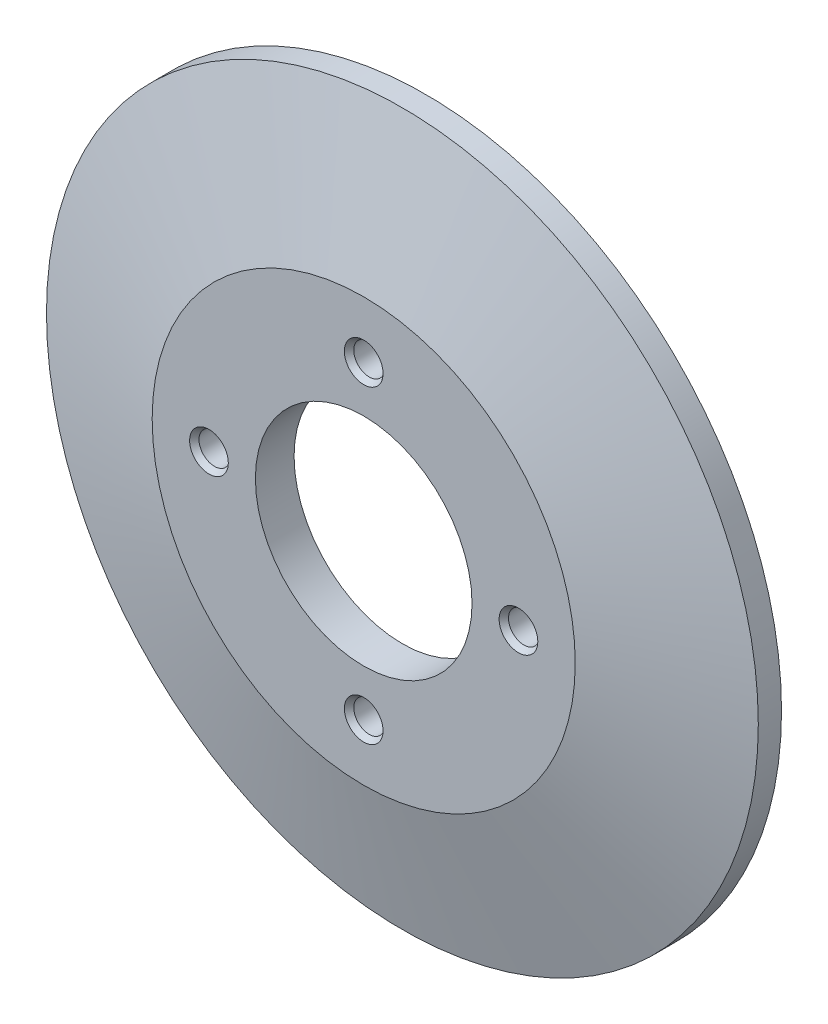
ISO-10303-21;
HEADER;
FILE_DESCRIPTION(('STEP AP214'),'2;1');
FILE_NAME('part.step','',(''),(''),'','','');
FILE_SCHEMA(('AUTOMOTIVE_DESIGN { 1 0 10303 214 1 1 1 1 }'));
ENDSEC;
DATA;
#1=APPLICATION_CONTEXT('core data for automotive mechanical design processes');
#2=APPLICATION_PROTOCOL_DEFINITION('international standard','automotive_design',2000,#1);
#3=PRODUCT_CONTEXT('',#1,'mechanical');
#4=PRODUCT('Part','Part','',(#3));
#5=PRODUCT_RELATED_PRODUCT_CATEGORY('part','',(#4));
#6=PRODUCT_DEFINITION_FORMATION('','',#4);
#7=PRODUCT_DEFINITION_CONTEXT('part definition',#1,'design');
#8=PRODUCT_DEFINITION('design','',#6,#7);
#9=PRODUCT_DEFINITION_SHAPE('','',#8);
#10=(LENGTH_UNIT() NAMED_UNIT(*) SI_UNIT(.MILLI.,.METRE.));
#11=(NAMED_UNIT(*) PLANE_ANGLE_UNIT() SI_UNIT($,.RADIAN.));
#12=(NAMED_UNIT(*) SI_UNIT($,.STERADIAN.) SOLID_ANGLE_UNIT());
#13=UNCERTAINTY_MEASURE_WITH_UNIT(LENGTH_MEASURE(1.E-05),#10,'distance_accuracy_value','');
#14=(GEOMETRIC_REPRESENTATION_CONTEXT(3) GLOBAL_UNCERTAINTY_ASSIGNED_CONTEXT((#13)) GLOBAL_UNIT_ASSIGNED_CONTEXT((#10,
#11,#12)) REPRESENTATION_CONTEXT('',''));
#15=CARTESIAN_POINT('',(0.,0.,0.));
#16=DIRECTION('',(0.,0.,1.));
#17=DIRECTION('',(1.,0.,0.));
#18=AXIS2_PLACEMENT_3D('',#15,#16,#17);
#19=CARTESIAN_POINT('',(0.,0.,3.));
#20=DIRECTION('',(0.,0.,-1.));
#21=DIRECTION('',(-1.,0.,0.));
#22=AXIS2_PLACEMENT_3D('',#19,#20,#21);
#23=CYLINDRICAL_SURFACE('',#22,46.);
#24=CARTESIAN_POINT('',(0.,0.,3.));
#25=DIRECTION('',(0.,0.,1.));
#26=DIRECTION('',(1.,0.,0.));
#27=AXIS2_PLACEMENT_3D('',#24,#25,#26);
#28=CIRCLE('',#27,46.);
#29=CARTESIAN_POINT('',(46.,0.,3.));
#30=VERTEX_POINT('',#29);
#31=EDGE_CURVE('E63',#30,#30,#28,.T.);
#32=ORIENTED_EDGE('',*,*,#31,.F.);
#33=EDGE_LOOP('',(#32));
#34=FACE_BOUND('',#33,.T.);
#35=CARTESIAN_POINT('',(0.,0.,0.));
#36=DIRECTION('',(0.,0.,1.));
#37=DIRECTION('',(1.,0.,0.));
#38=AXIS2_PLACEMENT_3D('',#35,#36,#37);
#39=CIRCLE('',#38,46.);
#40=CARTESIAN_POINT('',(46.,0.,0.));
#41=VERTEX_POINT('',#40);
#42=EDGE_CURVE('E81',#41,#41,#39,.T.);
#43=ORIENTED_EDGE('',*,*,#42,.T.);
#44=EDGE_LOOP('',(#43));
#45=FACE_BOUND('',#44,.T.);
#46=ADVANCED_FACE('F31',(#34,#45),#23,.T.);
#47=CARTESIAN_POINT('',(0.,0.,0.));
#48=DIRECTION('',(0.,0.,1.));
#49=DIRECTION('',(1.,0.,0.));
#50=AXIS2_PLACEMENT_3D('',#47,#48,#49);
#51=PLANE('',#50);
#52=CARTESIAN_POINT('',(0.,0.,0.));
#53=DIRECTION('',(0.,0.,1.));
#54=DIRECTION('',(1.,0.,0.));
#55=AXIS2_PLACEMENT_3D('',#52,#53,#54);
#56=CIRCLE('',#55,37.8776358969252);
#57=CARTESIAN_POINT('',(37.8776358969252,0.,0.));
#58=VERTEX_POINT('',#57);
#59=EDGE_CURVE('E89',#58,#58,#56,.T.);
#60=ORIENTED_EDGE('',*,*,#59,.T.);
#61=EDGE_LOOP('',(#60));
#62=FACE_BOUND('',#61,.T.);
#63=ORIENTED_EDGE('',*,*,#42,.F.);
#64=EDGE_LOOP('',(#63));
#65=FACE_BOUND('',#64,.T.);
#66=ADVANCED_FACE('F111',(#62,#65),#51,.F.);
#67=CARTESIAN_POINT('',(0.,0.,3.));
#68=DIRECTION('',(0.,0.,-1.));
#69=DIRECTION('',(1.,0.,0.));
#70=AXIS2_PLACEMENT_3D('',#67,#68,#69);
#71=CONICAL_SURFACE('',#70,46.,1.30899693899575);
#72=CARTESIAN_POINT('',(0.,0.,8.));
#73=DIRECTION('',(0.,0.,1.));
#74=DIRECTION('',(1.,0.,0.));
#75=AXIS2_PLACEMENT_3D('',#72,#73,#74);
#76=CIRCLE('',#75,27.3397459621555);
#77=CARTESIAN_POINT('',(27.3397459621555,0.,8.));
#78=VERTEX_POINT('',#77);
#79=EDGE_CURVE('E84',#78,#78,#76,.T.);
#80=ORIENTED_EDGE('',*,*,#79,.F.);
#81=EDGE_LOOP('',(#80));
#82=FACE_BOUND('',#81,.T.);
#83=ORIENTED_EDGE('',*,*,#31,.T.);
#84=EDGE_LOOP('',(#83));
#85=FACE_BOUND('',#84,.T.);
#86=ADVANCED_FACE('F104',(#82,#85),#71,.T.);
#87=CARTESIAN_POINT('',(0.,0.,8.));
#88=DIRECTION('',(0.,0.,1.));
#89=DIRECTION('',(1.,0.,0.));
#90=AXIS2_PLACEMENT_3D('',#87,#88,#89);
#91=PLANE('',#90);
#92=CARTESIAN_POINT('',(-19.9999999999994,-5.6843418860808E-13,8.));
#93=DIRECTION('',(0.,0.,1.));
#94=DIRECTION('',(1.,0.,0.));
#95=AXIS2_PLACEMENT_3D('',#92,#93,#94);
#96=CIRCLE('',#95,2.50000000000089);
#97=CARTESIAN_POINT('',(-17.4999999999985,-5.6843418860808E-13,8.));
#98=VERTEX_POINT('',#97);
#99=EDGE_CURVE('E46',#98,#98,#96,.F.);
#100=ORIENTED_EDGE('',*,*,#99,.T.);
#101=EDGE_LOOP('',(#100));
#102=FACE_BOUND('',#101,.T.);
#103=CARTESIAN_POINT('',(1.13196979001957E-12,-20.,8.));
#104=DIRECTION('',(0.,0.,1.));
#105=DIRECTION('',(1.,0.,0.));
#106=AXIS2_PLACEMENT_3D('',#103,#104,#105);
#107=CIRCLE('',#106,2.50000000000124);
#108=CARTESIAN_POINT('',(2.50000000000237,-20.,8.));
#109=VERTEX_POINT('',#108);
#110=EDGE_CURVE('E51',#109,#109,#107,.F.);
#111=ORIENTED_EDGE('',*,*,#110,.T.);
#112=EDGE_LOOP('',(#111));
#113=FACE_BOUND('',#112,.T.);
#114=CARTESIAN_POINT('',(20.0000000000006,5.65984895009786E-13,8.));
#115=DIRECTION('',(0.,0.,1.));
#116=DIRECTION('',(1.,0.,0.));
#117=AXIS2_PLACEMENT_3D('',#114,#115,#116);
#118=CIRCLE('',#117,2.50000000000045);
#119=CARTESIAN_POINT('',(22.500000000001,5.65984895009786E-13,8.));
#120=VERTEX_POINT('',#119);
#121=EDGE_CURVE('E54',#120,#120,#118,.F.);
#122=ORIENTED_EDGE('',*,*,#121,.T.);
#123=EDGE_LOOP('',(#122));
#124=FACE_BOUND('',#123,.T.);
#125=CARTESIAN_POINT('',(0.,20.,8.));
#126=DIRECTION('',(0.,0.,1.));
#127=DIRECTION('',(1.,0.,0.));
#128=AXIS2_PLACEMENT_3D('',#125,#126,#127);
#129=CIRCLE('',#128,2.50000000000002);
#130=CARTESIAN_POINT('',(2.50000000000002,20.,8.));
#131=VERTEX_POINT('',#130);
#132=EDGE_CURVE('E57',#131,#131,#129,.F.);
#133=ORIENTED_EDGE('',*,*,#132,.T.);
#134=EDGE_LOOP('',(#133));
#135=FACE_BOUND('',#134,.T.);
#136=CARTESIAN_POINT('',(0.,0.,8.));
#137=DIRECTION('',(0.,0.,1.));
#138=DIRECTION('',(1.,0.,0.));
#139=AXIS2_PLACEMENT_3D('',#136,#137,#138);
#140=CIRCLE('',#139,14.);
#141=CARTESIAN_POINT('',(14.,0.,8.));
#142=VERTEX_POINT('',#141);
#143=EDGE_CURVE('E68',#142,#142,#140,.T.);
#144=ORIENTED_EDGE('',*,*,#143,.F.);
#145=EDGE_LOOP('',(#144));
#146=FACE_BOUND('',#145,.T.);
#147=ORIENTED_EDGE('',*,*,#79,.T.);
#148=EDGE_LOOP('',(#147));
#149=FACE_BOUND('',#148,.T.);
#150=ADVANCED_FACE('F100',(#102,#113,#124,#135,#146,#149),#91,.T.);
#151=CARTESIAN_POINT('',(0.,0.,-1.82962913144534));
#152=DIRECTION('',(0.,0.,-1.));
#153=DIRECTION('',(1.,0.,0.));
#154=AXIS2_PLACEMENT_3D('',#151,#152,#153);
#155=CONICAL_SURFACE('',#154,44.7059047744874,1.30899693899575);
#156=CARTESIAN_POINT('',(0.,0.,3.));
#157=DIRECTION('',(0.,0.,1.));
#158=DIRECTION('',(1.,0.,0.));
#159=AXIS2_PLACEMENT_3D('',#156,#157,#158);
#160=CIRCLE('',#159,26.6814834742185);
#161=CARTESIAN_POINT('',(26.6814834742185,0.,3.));
#162=VERTEX_POINT('',#161);
#163=EDGE_CURVE('E80',#162,#162,#160,.T.);
#164=ORIENTED_EDGE('',*,*,#163,.T.);
#165=EDGE_LOOP('',(#164));
#166=FACE_BOUND('',#165,.T.);
#167=ORIENTED_EDGE('',*,*,#59,.F.);
#168=EDGE_LOOP('',(#167));
#169=FACE_BOUND('',#168,.T.);
#170=ADVANCED_FACE('F103',(#166,#169),#155,.F.);
#171=CARTESIAN_POINT('',(0.,0.,3.));
#172=DIRECTION('',(0.,0.,1.));
#173=DIRECTION('',(1.,0.,0.));
#174=AXIS2_PLACEMENT_3D('',#171,#172,#173);
#175=PLANE('',#174);
#176=CARTESIAN_POINT('',(0.,0.,3.));
#177=DIRECTION('',(0.,0.,1.));
#178=DIRECTION('',(1.,0.,0.));
#179=AXIS2_PLACEMENT_3D('',#176,#177,#178);
#180=CIRCLE('',#179,14.);
#181=CARTESIAN_POINT('',(14.,0.,3.));
#182=VERTEX_POINT('',#181);
#183=EDGE_CURVE('E64',#182,#182,#180,.T.);
#184=ORIENTED_EDGE('',*,*,#183,.T.);
#185=EDGE_LOOP('',(#184));
#186=FACE_BOUND('',#185,.T.);
#187=CARTESIAN_POINT('',(20.0000000000006,5.65984895009786E-13,3.));
#188=DIRECTION('',(0.,0.,1.));
#189=DIRECTION('',(1.,0.,0.));
#190=AXIS2_PLACEMENT_3D('',#187,#188,#189);
#191=CIRCLE('',#190,2.00000000000044);
#192=CARTESIAN_POINT('',(22.000000000001,5.65984895009786E-13,3.));
#193=VERTEX_POINT('',#192);
#194=EDGE_CURVE('E69',#193,#193,#191,.T.);
#195=ORIENTED_EDGE('',*,*,#194,.T.);
#196=EDGE_LOOP('',(#195));
#197=FACE_BOUND('',#196,.T.);
#198=CARTESIAN_POINT('',(1.13196979001957E-12,-20.,3.));
#199=DIRECTION('',(0.,0.,1.));
#200=DIRECTION('',(1.,0.,0.));
#201=AXIS2_PLACEMENT_3D('',#198,#199,#200);
#202=CIRCLE('',#201,2.00000000000122);
#203=CARTESIAN_POINT('',(2.00000000000235,-20.,3.));
#204=VERTEX_POINT('',#203);
#205=EDGE_CURVE('E73',#204,#204,#202,.T.);
#206=ORIENTED_EDGE('',*,*,#205,.T.);
#207=EDGE_LOOP('',(#206));
#208=FACE_BOUND('',#207,.T.);
#209=CARTESIAN_POINT('',(-19.9999999999994,-5.6843418860808E-13,3.));
#210=DIRECTION('',(0.,0.,1.));
#211=DIRECTION('',(1.,0.,0.));
#212=AXIS2_PLACEMENT_3D('',#209,#210,#211);
#213=CIRCLE('',#212,2.00000000000091);
#214=CARTESIAN_POINT('',(-17.9999999999985,-5.6843418860808E-13,3.));
#215=VERTEX_POINT('',#214);
#216=EDGE_CURVE('E67',#215,#215,#213,.T.);
#217=ORIENTED_EDGE('',*,*,#216,.T.);
#218=EDGE_LOOP('',(#217));
#219=FACE_BOUND('',#218,.T.);
#220=CARTESIAN_POINT('',(0.,20.,3.));
#221=DIRECTION('',(0.,0.,1.));
#222=DIRECTION('',(1.,0.,0.));
#223=AXIS2_PLACEMENT_3D('',#220,#221,#222);
#224=CIRCLE('',#223,2.);
#225=CARTESIAN_POINT('',(2.,20.,3.));
#226=VERTEX_POINT('',#225);
#227=EDGE_CURVE('E72',#226,#226,#224,.T.);
#228=ORIENTED_EDGE('',*,*,#227,.T.);
#229=EDGE_LOOP('',(#228));
#230=FACE_BOUND('',#229,.T.);
#231=ORIENTED_EDGE('',*,*,#163,.F.);
#232=EDGE_LOOP('',(#231));
#233=FACE_BOUND('',#232,.T.);
#234=ADVANCED_FACE('F197',(#186,#197,#208,#219,#230,#233),#175,.F.);
#235=CARTESIAN_POINT('',(0.,20.,0.));
#236=DIRECTION('',(0.,0.,1.));
#237=DIRECTION('',(1.,0.,0.));
#238=AXIS2_PLACEMENT_3D('',#235,#236,#237);
#239=CYLINDRICAL_SURFACE('',#238,2.);
#240=CARTESIAN_POINT('',(0.,20.,7.28592599662892));
#241=DIRECTION('',(0.,0.,1.));
#242=DIRECTION('',(1.,0.,0.));
#243=AXIS2_PLACEMENT_3D('',#240,#241,#242);
#244=CIRCLE('',#243,2.);
#245=CARTESIAN_POINT('',(2.,20.,7.28592599662892));
#246=VERTEX_POINT('',#245);
#247=EDGE_CURVE('E10',#246,#246,#244,.T.);
#248=ORIENTED_EDGE('',*,*,#247,.T.);
#249=EDGE_LOOP('',(#248));
#250=FACE_BOUND('',#249,.T.);
#251=ORIENTED_EDGE('',*,*,#227,.F.);
#252=EDGE_LOOP('',(#251));
#253=FACE_BOUND('',#252,.T.);
#254=ADVANCED_FACE('F190',(#250,#253),#239,.F.);
#255=CARTESIAN_POINT('',(-19.9999999999994,-5.6843418860808E-13,0.));
#256=DIRECTION('',(0.,0.,1.));
#257=DIRECTION('',(1.,0.,0.));
#258=AXIS2_PLACEMENT_3D('',#255,#256,#257);
#259=CYLINDRICAL_SURFACE('',#258,2.00000000000091);
#260=CARTESIAN_POINT('',(-19.9999999999994,-5.6843418860808E-13,7.28592599662897));
#261=DIRECTION('',(0.,0.,1.));
#262=DIRECTION('',(1.,0.,0.));
#263=AXIS2_PLACEMENT_3D('',#260,#261,#262);
#264=CIRCLE('',#263,2.00000000000091);
#265=CARTESIAN_POINT('',(-17.9999999999985,-5.6843418860808E-13,7.28592599662897));
#266=VERTEX_POINT('',#265);
#267=EDGE_CURVE('E60',#266,#266,#264,.T.);
#268=ORIENTED_EDGE('',*,*,#267,.T.);
#269=EDGE_LOOP('',(#268));
#270=FACE_BOUND('',#269,.T.);
#271=ORIENTED_EDGE('',*,*,#216,.F.);
#272=EDGE_LOOP('',(#271));
#273=FACE_BOUND('',#272,.T.);
#274=ADVANCED_FACE('F182',(#270,#273),#259,.F.);
#275=CARTESIAN_POINT('',(1.13196979001957E-12,-20.,0.));
#276=DIRECTION('',(0.,0.,1.));
#277=DIRECTION('',(1.,0.,0.));
#278=AXIS2_PLACEMENT_3D('',#275,#276,#277);
#279=CYLINDRICAL_SURFACE('',#278,2.00000000000122);
#280=CARTESIAN_POINT('',(1.13196979001957E-12,-20.,7.28592599662894));
#281=DIRECTION('',(0.,0.,1.));
#282=DIRECTION('',(1.,0.,0.));
#283=AXIS2_PLACEMENT_3D('',#280,#281,#282);
#284=CIRCLE('',#283,2.00000000000122);
#285=CARTESIAN_POINT('',(2.00000000000235,-20.,7.28592599662894));
#286=VERTEX_POINT('',#285);
#287=EDGE_CURVE('E42',#286,#286,#284,.T.);
#288=ORIENTED_EDGE('',*,*,#287,.T.);
#289=EDGE_LOOP('',(#288));
#290=FACE_BOUND('',#289,.T.);
#291=ORIENTED_EDGE('',*,*,#205,.F.);
#292=EDGE_LOOP('',(#291));
#293=FACE_BOUND('',#292,.T.);
#294=ADVANCED_FACE('F175',(#290,#293),#279,.F.);
#295=CARTESIAN_POINT('',(20.0000000000006,5.65984895009786E-13,0.));
#296=DIRECTION('',(0.,0.,1.));
#297=DIRECTION('',(1.,0.,0.));
#298=AXIS2_PLACEMENT_3D('',#295,#296,#297);
#299=CYLINDRICAL_SURFACE('',#298,2.00000000000044);
#300=CARTESIAN_POINT('',(20.0000000000006,5.65984895009786E-13,7.28592599662894));
#301=DIRECTION('',(0.,0.,1.));
#302=DIRECTION('',(1.,0.,0.));
#303=AXIS2_PLACEMENT_3D('',#300,#301,#302);
#304=CIRCLE('',#303,2.00000000000044);
#305=CARTESIAN_POINT('',(22.000000000001,5.65984895009786E-13,7.28592599662894));
#306=VERTEX_POINT('',#305);
#307=EDGE_CURVE('E38',#306,#306,#304,.T.);
#308=ORIENTED_EDGE('',*,*,#307,.T.);
#309=EDGE_LOOP('',(#308));
#310=FACE_BOUND('',#309,.T.);
#311=ORIENTED_EDGE('',*,*,#194,.F.);
#312=EDGE_LOOP('',(#311));
#313=FACE_BOUND('',#312,.T.);
#314=ADVANCED_FACE('F171',(#310,#313),#299,.F.);
#315=CARTESIAN_POINT('',(0.,0.,0.));
#316=DIRECTION('',(0.,0.,1.));
#317=DIRECTION('',(1.,0.,0.));
#318=AXIS2_PLACEMENT_3D('',#315,#316,#317);
#319=CYLINDRICAL_SURFACE('',#318,14.);
#320=ORIENTED_EDGE('',*,*,#143,.T.);
#321=EDGE_LOOP('',(#320));
#322=FACE_BOUND('',#321,.T.);
#323=ORIENTED_EDGE('',*,*,#183,.F.);
#324=EDGE_LOOP('',(#323));
#325=FACE_BOUND('',#324,.T.);
#326=ADVANCED_FACE('F97',(#322,#325),#319,.F.);
#327=CARTESIAN_POINT('',(-19.9999999999994,-5.6843418860808E-13,7.28592599662897));
#328=DIRECTION('',(0.,0.,1.));
#329=DIRECTION('',(1.,0.,0.));
#330=AXIS2_PLACEMENT_3D('',#327,#328,#329);
#331=CONICAL_SURFACE('',#330,2.00000000000091,0.610865238198017);
#332=CARTESIAN_POINT('',(-17.4999999999985,-5.6843418860808E-13,8.));
#333=CARTESIAN_POINT('',(-17.5052083333319,-5.6843418860808E-13,7.99256172913155));
#334=CARTESIAN_POINT('',(-17.5104166666652,-5.6843418860808E-13,7.9851234582631));
#335=CARTESIAN_POINT('',(-17.5208333333319,-5.6843418860808E-13,7.97024691652621));
#336=CARTESIAN_POINT('',(-17.5260416666652,-5.6843418860808E-13,7.96280864565776));
#337=CARTESIAN_POINT('',(-17.5364583333319,-5.6843418860808E-13,7.94793210392086));
#338=CARTESIAN_POINT('',(-17.5416666666652,-5.6843418860808E-13,7.94049383305241));
#339=CARTESIAN_POINT('',(-17.5520833333319,-5.6843418860808E-13,7.92561729131552));
#340=CARTESIAN_POINT('',(-17.5572916666652,-5.6843418860808E-13,7.91817902044707));
#341=CARTESIAN_POINT('',(-17.5677083333319,-5.6843418860808E-13,7.90330247871017));
#342=CARTESIAN_POINT('',(-17.5729166666652,-5.6843418860808E-13,7.89586420784172));
#343=CARTESIAN_POINT('',(-17.5833333333319,-5.6843418860808E-13,7.88098766610483));
#344=CARTESIAN_POINT('',(-17.5885416666652,-5.6843418860808E-13,7.87354939523638));
#345=CARTESIAN_POINT('',(-17.5989583333319,-5.6843418860808E-13,7.85867285349948));
#346=CARTESIAN_POINT('',(-17.6041666666652,-5.6843418860808E-13,7.85123458263103));
#347=CARTESIAN_POINT('',(-17.6145833333319,-5.6843418860808E-13,7.83635804089414));
#348=CARTESIAN_POINT('',(-17.6197916666652,-5.6843418860808E-13,7.82891977002569));
#349=CARTESIAN_POINT('',(-17.6302083333319,-5.6843418860808E-13,7.81404322828879));
#350=CARTESIAN_POINT('',(-17.6354166666652,-5.6843418860808E-13,7.80660495742034));
#351=CARTESIAN_POINT('',(-17.6458333333319,-5.6843418860808E-13,7.79172841568345));
#352=CARTESIAN_POINT('',(-17.6510416666652,-5.6843418860808E-13,7.784290144815));
#353=CARTESIAN_POINT('',(-17.6614583333319,-5.6843418860808E-13,7.7694136030781));
#354=CARTESIAN_POINT('',(-17.6666666666652,-5.6843418860808E-13,7.76197533220966));
#355=CARTESIAN_POINT('',(-17.6770833333319,-5.6843418860808E-13,7.74709879047276));
#356=CARTESIAN_POINT('',(-17.6822916666652,-5.6843418860808E-13,7.73966051960431));
#357=CARTESIAN_POINT('',(-17.6927083333319,-5.6843418860808E-13,7.72478397786741));
#358=CARTESIAN_POINT('',(-17.6979166666652,-5.6843418860808E-13,7.71734570699897));
#359=CARTESIAN_POINT('',(-17.7083333333319,-5.6843418860808E-13,7.70246916526207));
#360=CARTESIAN_POINT('',(-17.7135416666652,-5.6843418860808E-13,7.69503089439362));
#361=CARTESIAN_POINT('',(-17.7239583333319,-5.6843418860808E-13,7.68015435265673));
#362=CARTESIAN_POINT('',(-17.7291666666652,-5.6843418860808E-13,7.67271608178828));
#363=CARTESIAN_POINT('',(-17.7395833333319,-5.6843418860808E-13,7.65783954005138));
#364=CARTESIAN_POINT('',(-17.7447916666652,-5.6843418860808E-13,7.65040126918293));
#365=CARTESIAN_POINT('',(-17.7552083333319,-5.6843418860808E-13,7.63552472744604));
#366=CARTESIAN_POINT('',(-17.7604166666652,-5.6843418860808E-13,7.62808645657759));
#367=CARTESIAN_POINT('',(-17.7708333333319,-5.6843418860808E-13,7.61320991484069));
#368=CARTESIAN_POINT('',(-17.7760416666652,-5.6843418860808E-13,7.60577164397224));
#369=CARTESIAN_POINT('',(-17.7864583333319,-5.6843418860808E-13,7.59089510223535));
#370=CARTESIAN_POINT('',(-17.7916666666652,-5.6843418860808E-13,7.5834568313669));
#371=CARTESIAN_POINT('',(-17.8020833333319,-5.6843418860808E-13,7.56858028963));
#372=CARTESIAN_POINT('',(-17.8072916666652,-5.6843418860808E-13,7.56114201876155));
#373=CARTESIAN_POINT('',(-17.8177083333319,-5.6843418860808E-13,7.54626547702466));
#374=CARTESIAN_POINT('',(-17.8229166666652,-5.6843418860808E-13,7.53882720615621));
#375=CARTESIAN_POINT('',(-17.8333333333319,-5.6843418860808E-13,7.52395066441931));
#376=CARTESIAN_POINT('',(-17.8385416666652,-5.6843418860808E-13,7.51651239355086));
#377=CARTESIAN_POINT('',(-17.8489583333319,-5.6843418860808E-13,7.50163585181397));
#378=CARTESIAN_POINT('',(-17.8541666666652,-5.6843418860808E-13,7.49419758094552));
#379=CARTESIAN_POINT('',(-17.8645833333319,-5.6843418860808E-13,7.47932103920862));
#380=CARTESIAN_POINT('',(-17.8697916666652,-5.6843418860808E-13,7.47188276834018));
#381=CARTESIAN_POINT('',(-17.8802083333319,-5.6843418860808E-13,7.45700622660328));
#382=CARTESIAN_POINT('',(-17.8854166666652,-5.6843418860808E-13,7.44956795573483));
#383=CARTESIAN_POINT('',(-17.8958333333319,-5.6843418860808E-13,7.43469141399793));
#384=CARTESIAN_POINT('',(-17.9010416666652,-5.6843418860808E-13,7.42725314312949));
#385=CARTESIAN_POINT('',(-17.9114583333319,-5.6843418860808E-13,7.41237660139259));
#386=CARTESIAN_POINT('',(-17.9166666666652,-5.6843418860808E-13,7.40493833052414));
#387=CARTESIAN_POINT('',(-17.9270833333319,-5.6843418860808E-13,7.39006178878724));
#388=CARTESIAN_POINT('',(-17.9322916666652,-5.6843418860808E-13,7.3826235179188));
#389=CARTESIAN_POINT('',(-17.9427083333319,-5.6843418860808E-13,7.3677469761819));
#390=CARTESIAN_POINT('',(-17.9479166666652,-5.6843418860808E-13,7.36030870531345));
#391=CARTESIAN_POINT('',(-17.9583333333319,-5.6843418860808E-13,7.34543216357656));
#392=CARTESIAN_POINT('',(-17.9635416666652,-5.6843418860808E-13,7.33799389270811));
#393=CARTESIAN_POINT('',(-17.9739583333319,-5.6843418860808E-13,7.32311735097121));
#394=CARTESIAN_POINT('',(-17.9791666666652,-5.6843418860808E-13,7.31567908010276));
#395=CARTESIAN_POINT('',(-17.9895833333319,-5.6843418860808E-13,7.30080253836587));
#396=CARTESIAN_POINT('',(-17.9947916666652,-5.6843418860808E-13,7.29336426749742));
#397=CARTESIAN_POINT('',(-17.9999999999985,-5.6843418860808E-13,7.28592599662897));
#398=B_SPLINE_CURVE_WITH_KNOTS('',3,(#332,#333,#334,#335,#336,#337,#338,#339,#340,#341,#342,
#343,#344,#345,#346,#347,#348,#349,#350,#351,#352,#353,#354,#355,#356,#357,#358,#359,#360,#361,
#362,#363,#364,#365,#366,#367,#368,#369,#370,#371,#372,#373,#374,#375,#376,#377,#378,#379,#380,
#381,#382,#383,#384,#385,#386,#387,#388,#389,#390,#391,#392,#393,#394,#395,#396,#397),
.UNSPECIFIED.,.F.,.F.,(4,2,2,2,2,2,2,2,2,2,2,2,2,2,2,2,2,2,2,2,2,2,2,2,2,2,2,2,2,2,2,2,4),(0.,
0.0272413561815767,0.0544827123631568,0.0817240685447349,0.108965424726315,0.136206780907893,
0.163448137089471,0.190689493271049,0.217930849452629,0.245172205634207,0.272413561815787,
0.299654917997365,0.326896274178943,0.35413763036052,0.3813789865421,0.408620342723679,
0.435861698905259,0.463103055086837,0.490344411268414,0.517585767449992,0.544827123631572,
0.57206847981315,0.599309835994728,0.626551192176308,0.653792548357886,0.681033904539464,
0.708275260721044,0.735516616902622,0.762757973084199,0.789999329265779,0.817240685447358,
0.844482041628936,0.871723397810515),.UNSPECIFIED.);
#399=EDGE_CURVE('BSEAM126',#98,#266,#398,.T.);
#400=ORIENTED_EDGE('',*,*,#99,.F.);
#401=ORIENTED_EDGE('',*,*,#267,.F.);
#402=ORIENTED_EDGE('',*,*,#399,.T.);
#403=ORIENTED_EDGE('',*,*,#399,.F.);
#404=EDGE_LOOP('',(#400,#402,#401,#403));
#405=FACE_BOUND('',#404,.T.);
#406=ADVANCED_FACE('F126',(#405),#331,.F.);
#407=CARTESIAN_POINT('',(1.13196979001957E-12,-20.,7.28592599662894));
#408=DIRECTION('',(0.,0.,1.));
#409=DIRECTION('',(1.,0.,0.));
#410=AXIS2_PLACEMENT_3D('',#407,#408,#409);
#411=CONICAL_SURFACE('',#410,2.00000000000122,0.610865238198033);
#412=ORIENTED_EDGE('',*,*,#110,.F.);
#413=EDGE_LOOP('',(#412));
#414=FACE_BOUND('',#413,.T.);
#415=ORIENTED_EDGE('',*,*,#287,.F.);
#416=EDGE_LOOP('',(#415));
#417=FACE_BOUND('',#416,.T.);
#418=ADVANCED_FACE('F129',(#414,#417),#411,.F.);
#419=CARTESIAN_POINT('',(20.0000000000006,5.65984895009786E-13,7.28592599662894));
#420=DIRECTION('',(0.,0.,1.));
#421=DIRECTION('',(1.,0.,0.));
#422=AXIS2_PLACEMENT_3D('',#419,#420,#421);
#423=CONICAL_SURFACE('',#422,2.00000000000044,0.610865238198019);
#424=ORIENTED_EDGE('',*,*,#121,.F.);
#425=EDGE_LOOP('',(#424));
#426=FACE_BOUND('',#425,.T.);
#427=ORIENTED_EDGE('',*,*,#307,.F.);
#428=EDGE_LOOP('',(#427));
#429=FACE_BOUND('',#428,.T.);
#430=ADVANCED_FACE('F132',(#426,#429),#423,.F.);
#431=CARTESIAN_POINT('',(0.,20.,7.28592599662892));
#432=DIRECTION('',(0.,0.,1.));
#433=DIRECTION('',(1.,0.,0.));
#434=AXIS2_PLACEMENT_3D('',#431,#432,#433);
#435=CONICAL_SURFACE('',#434,2.,0.610865238198017);
#436=ORIENTED_EDGE('',*,*,#132,.F.);
#437=EDGE_LOOP('',(#436));
#438=FACE_BOUND('',#437,.T.);
#439=ORIENTED_EDGE('',*,*,#247,.F.);
#440=EDGE_LOOP('',(#439));
#441=FACE_BOUND('',#440,.T.);
#442=ADVANCED_FACE('F33',(#438,#441),#435,.F.);
#443=CLOSED_SHELL('',(#46,#66,#86,#150,#170,#234,#254,#274,#294,#314,#326,#406,#418,#430,#442));
#444=MANIFOLD_SOLID_BREP('B2',#443);
#445=ADVANCED_BREP_SHAPE_REPRESENTATION('',(#18,#444),#14);
#446=SHAPE_DEFINITION_REPRESENTATION(#9,#445);
ENDSEC;
END-ISO-10303-21;
